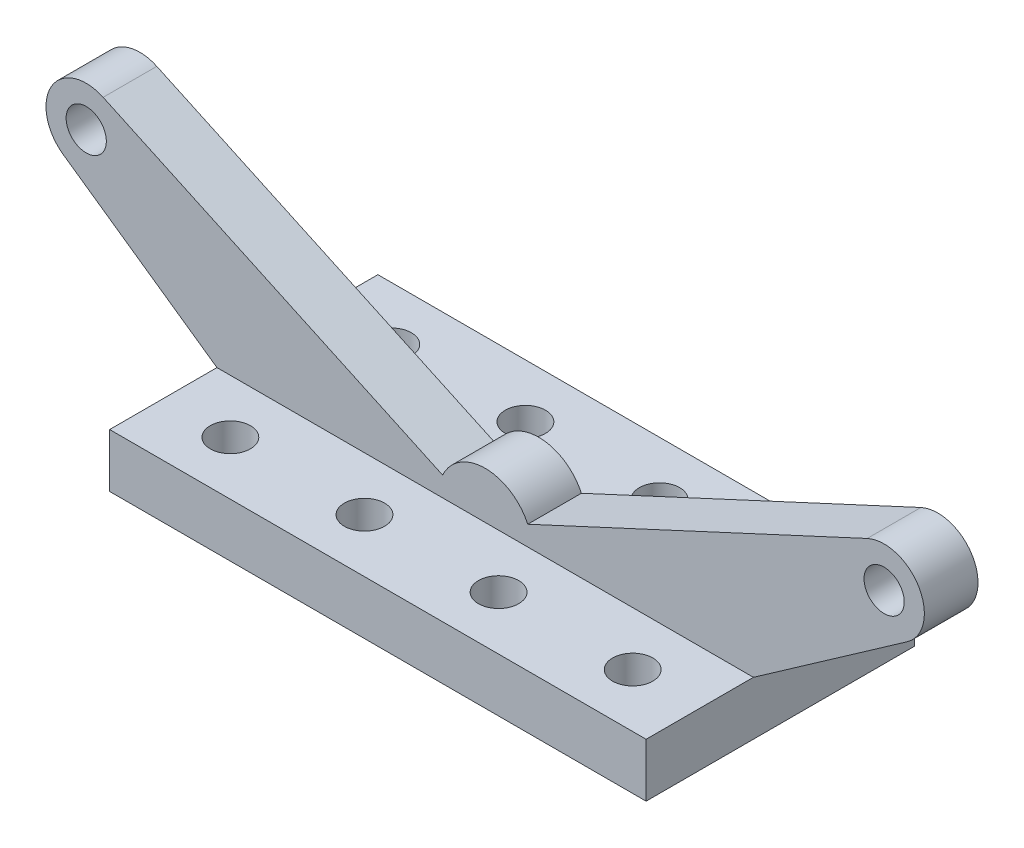
ISO-10303-21;
HEADER;
FILE_DESCRIPTION(('STEP AP214'),'2;1');
FILE_NAME('part.step','',(''),(''),'','','');
FILE_SCHEMA(('AUTOMOTIVE_DESIGN { 1 0 10303 214 1 1 1 1 }'));
ENDSEC;
DATA;
#1=APPLICATION_CONTEXT('core data for automotive mechanical design processes');
#2=APPLICATION_PROTOCOL_DEFINITION('international standard','automotive_design',2000,#1);
#3=PRODUCT_CONTEXT('',#1,'mechanical');
#4=PRODUCT('Part','Part','',(#3));
#5=PRODUCT_RELATED_PRODUCT_CATEGORY('part','',(#4));
#6=PRODUCT_DEFINITION_FORMATION('','',#4);
#7=PRODUCT_DEFINITION_CONTEXT('part definition',#1,'design');
#8=PRODUCT_DEFINITION('design','',#6,#7);
#9=PRODUCT_DEFINITION_SHAPE('','',#8);
#10=(LENGTH_UNIT() NAMED_UNIT(*) SI_UNIT(.MILLI.,.METRE.));
#11=(NAMED_UNIT(*) PLANE_ANGLE_UNIT() SI_UNIT($,.RADIAN.));
#12=(NAMED_UNIT(*) SI_UNIT($,.STERADIAN.) SOLID_ANGLE_UNIT());
#13=UNCERTAINTY_MEASURE_WITH_UNIT(LENGTH_MEASURE(1.E-05),#10,'distance_accuracy_value','');
#14=(GEOMETRIC_REPRESENTATION_CONTEXT(3) GLOBAL_UNCERTAINTY_ASSIGNED_CONTEXT((#13)) GLOBAL_UNIT_ASSIGNED_CONTEXT((#10,
#11,#12)) REPRESENTATION_CONTEXT('',''));
#15=CARTESIAN_POINT('',(0.,0.,0.));
#16=DIRECTION('',(0.,0.,1.));
#17=DIRECTION('',(1.,0.,0.));
#18=AXIS2_PLACEMENT_3D('',#15,#16,#17);
#19=CARTESIAN_POINT('',(0.,20.,0.));
#20=DIRECTION('',(0.,1.,0.));
#21=DIRECTION('',(0.,0.,1.));
#22=AXIS2_PLACEMENT_3D('',#19,#20,#21);
#23=PLANE('',#22);
#24=CARTESIAN_POINT('',(-75.,20.,-30.));
#25=DIRECTION('',(0.,1.,0.));
#26=DIRECTION('',(0.,0.,1.));
#27=AXIS2_PLACEMENT_3D('',#24,#25,#26);
#28=CIRCLE('',#27,7.50000000000001);
#29=CARTESIAN_POINT('',(-75.,20.,-22.5));
#30=VERTEX_POINT('',#29);
#31=EDGE_CURVE('E206',#30,#30,#28,.T.);
#32=ORIENTED_EDGE('',*,*,#31,.F.);
#33=EDGE_LOOP('',(#32));
#34=FACE_BOUND('',#33,.T.);
#35=CARTESIAN_POINT('',(75.,20.,-30.));
#36=DIRECTION('',(0.,1.,0.));
#37=DIRECTION('',(0.,0.,1.));
#38=AXIS2_PLACEMENT_3D('',#35,#36,#37);
#39=CIRCLE('',#38,7.50000000000001);
#40=CARTESIAN_POINT('',(75.,20.,-22.5));
#41=VERTEX_POINT('',#40);
#42=EDGE_CURVE('E219',#41,#41,#39,.T.);
#43=ORIENTED_EDGE('',*,*,#42,.F.);
#44=EDGE_LOOP('',(#43));
#45=FACE_BOUND('',#44,.T.);
#46=CARTESIAN_POINT('',(25.,20.,-30.));
#47=DIRECTION('',(0.,1.,0.));
#48=DIRECTION('',(0.,0.,1.));
#49=AXIS2_PLACEMENT_3D('',#46,#47,#48);
#50=CIRCLE('',#49,7.50000000000001);
#51=CARTESIAN_POINT('',(25.,20.,-22.5));
#52=VERTEX_POINT('',#51);
#53=EDGE_CURVE('E213',#52,#52,#50,.T.);
#54=ORIENTED_EDGE('',*,*,#53,.F.);
#55=EDGE_LOOP('',(#54));
#56=FACE_BOUND('',#55,.T.);
#57=CARTESIAN_POINT('',(-25.,20.,-30.));
#58=DIRECTION('',(0.,1.,0.));
#59=DIRECTION('',(0.,0.,1.));
#60=AXIS2_PLACEMENT_3D('',#57,#58,#59);
#61=CIRCLE('',#60,7.50000000000001);
#62=CARTESIAN_POINT('',(-25.,20.,-22.5));
#63=VERTEX_POINT('',#62);
#64=EDGE_CURVE('E207',#63,#63,#61,.T.);
#65=ORIENTED_EDGE('',*,*,#64,.F.);
#66=EDGE_LOOP('',(#65));
#67=FACE_BOUND('',#66,.T.);
#68=DIRECTION('',(0.,0.,1.));
#69=VECTOR('',#68,1.);
#70=CARTESIAN_POINT('',(-100.,20.,-50.));
#71=LINE('',#70,#69);
#72=CARTESIAN_POINT('',(-100.,20.,-50.));
#73=VERTEX_POINT('',#72);
#74=CARTESIAN_POINT('',(-100.,20.,-10.));
#75=VERTEX_POINT('',#74);
#76=EDGE_CURVE('E253',#73,#75,#71,.T.);
#77=ORIENTED_EDGE('',*,*,#76,.T.);
#78=DIRECTION('',(1.,0.,0.));
#79=VECTOR('',#78,1.);
#80=CARTESIAN_POINT('',(-100.,20.,-10.));
#81=LINE('',#80,#79);
#82=CARTESIAN_POINT('',(100.,20.,-10.));
#83=VERTEX_POINT('',#82);
#84=EDGE_CURVE('E171',#75,#83,#81,.T.);
#85=ORIENTED_EDGE('',*,*,#84,.T.);
#86=DIRECTION('',(0.,0.,-1.));
#87=VECTOR('',#86,1.);
#88=CARTESIAN_POINT('',(100.,20.,-50.));
#89=LINE('',#88,#87);
#90=CARTESIAN_POINT('',(100.,20.,-50.));
#91=VERTEX_POINT('',#90);
#92=EDGE_CURVE('E131',#83,#91,#89,.T.);
#93=ORIENTED_EDGE('',*,*,#92,.T.);
#94=DIRECTION('',(-1.,0.,0.));
#95=VECTOR('',#94,1.);
#96=CARTESIAN_POINT('',(-100.,20.,-50.));
#97=LINE('',#96,#95);
#98=EDGE_CURVE('E130',#91,#73,#97,.T.);
#99=ORIENTED_EDGE('',*,*,#98,.T.);
#100=EDGE_LOOP('',(#77,#85,#93,#99));
#101=FACE_BOUND('',#100,.T.);
#102=ADVANCED_FACE('F33',(#34,#45,#56,#67,#101),#23,.T.);
#103=CARTESIAN_POINT('',(100.,20.,-50.));
#104=DIRECTION('',(-1.,0.,0.));
#105=DIRECTION('',(0.,0.,1.));
#106=AXIS2_PLACEMENT_3D('',#103,#104,#105);
#107=PLANE('',#106);
#108=DIRECTION('',(0.,0.,-1.));
#109=VECTOR('',#108,1.);
#110=CARTESIAN_POINT('',(100.,0.,-50.));
#111=LINE('',#110,#109);
#112=CARTESIAN_POINT('',(100.,0.,50.));
#113=VERTEX_POINT('',#112);
#114=CARTESIAN_POINT('',(100.,0.,-50.));
#115=VERTEX_POINT('',#114);
#116=EDGE_CURVE('E248',#113,#115,#111,.T.);
#117=ORIENTED_EDGE('',*,*,#116,.T.);
#118=DIRECTION('',(0.,-1.,0.));
#119=VECTOR('',#118,1.);
#120=CARTESIAN_POINT('',(100.,20.,-50.));
#121=LINE('',#120,#119);
#122=EDGE_CURVE('E11',#91,#115,#121,.T.);
#123=ORIENTED_EDGE('',*,*,#122,.F.);
#124=ORIENTED_EDGE('',*,*,#92,.F.);
#125=DIRECTION('',(0.,0.,-1.));
#126=VECTOR('',#125,1.);
#127=CARTESIAN_POINT('',(100.,20.,10.));
#128=LINE('',#127,#126);
#129=CARTESIAN_POINT('',(100.,20.,10.));
#130=VERTEX_POINT('',#129);
#131=EDGE_CURVE('E135',#130,#83,#128,.T.);
#132=ORIENTED_EDGE('',*,*,#131,.F.);
#133=CARTESIAN_POINT('',(100.,20.,50.));
#134=VERTEX_POINT('',#133);
#135=EDGE_CURVE('E121',#134,#130,#89,.T.);
#136=ORIENTED_EDGE('',*,*,#135,.F.);
#137=DIRECTION('',(0.,-1.,0.));
#138=VECTOR('',#137,1.);
#139=CARTESIAN_POINT('',(100.,20.,50.));
#140=LINE('',#139,#138);
#141=EDGE_CURVE('E256',#134,#113,#140,.T.);
#142=ORIENTED_EDGE('',*,*,#141,.T.);
#143=EDGE_LOOP('',(#117,#123,#124,#132,#136,#142));
#144=FACE_BOUND('',#143,.T.);
#145=ADVANCED_FACE('F35',(#144),#107,.F.);
#146=CARTESIAN_POINT('',(-100.,20.,-50.));
#147=DIRECTION('',(0.,0.,1.));
#148=DIRECTION('',(1.,0.,0.));
#149=AXIS2_PLACEMENT_3D('',#146,#147,#148);
#150=PLANE('',#149);
#151=DIRECTION('',(-1.,0.,0.));
#152=VECTOR('',#151,1.);
#153=CARTESIAN_POINT('',(-100.,0.,-50.));
#154=LINE('',#153,#152);
#155=CARTESIAN_POINT('',(-100.,0.,-50.));
#156=VERTEX_POINT('',#155);
#157=EDGE_CURVE('E258',#115,#156,#154,.T.);
#158=ORIENTED_EDGE('',*,*,#157,.T.);
#159=DIRECTION('',(0.,-1.,0.));
#160=VECTOR('',#159,1.);
#161=CARTESIAN_POINT('',(-100.,20.,-50.));
#162=LINE('',#161,#160);
#163=EDGE_CURVE('E41',#73,#156,#162,.T.);
#164=ORIENTED_EDGE('',*,*,#163,.F.);
#165=ORIENTED_EDGE('',*,*,#98,.F.);
#166=ORIENTED_EDGE('',*,*,#122,.T.);
#167=EDGE_LOOP('',(#158,#164,#165,#166));
#168=FACE_BOUND('',#167,.T.);
#169=ADVANCED_FACE('F280',(#168),#150,.F.);
#170=CARTESIAN_POINT('',(-100.,20.,-50.));
#171=DIRECTION('',(1.,0.,0.));
#172=DIRECTION('',(0.,0.,-1.));
#173=AXIS2_PLACEMENT_3D('',#170,#171,#172);
#174=PLANE('',#173);
#175=DIRECTION('',(0.,0.,1.));
#176=VECTOR('',#175,1.);
#177=CARTESIAN_POINT('',(-100.,0.,-50.));
#178=LINE('',#177,#176);
#179=CARTESIAN_POINT('',(-100.,0.,50.));
#180=VERTEX_POINT('',#179);
#181=EDGE_CURVE('E260',#156,#180,#178,.T.);
#182=ORIENTED_EDGE('',*,*,#181,.T.);
#183=DIRECTION('',(0.,-1.,0.));
#184=VECTOR('',#183,1.);
#185=CARTESIAN_POINT('',(-100.,20.,50.));
#186=LINE('',#185,#184);
#187=CARTESIAN_POINT('',(-100.,20.,50.));
#188=VERTEX_POINT('',#187);
#189=EDGE_CURVE('E265',#188,#180,#186,.T.);
#190=ORIENTED_EDGE('',*,*,#189,.F.);
#191=CARTESIAN_POINT('',(-100.,20.,10.));
#192=VERTEX_POINT('',#191);
#193=EDGE_CURVE('E252',#192,#188,#71,.T.);
#194=ORIENTED_EDGE('',*,*,#193,.F.);
#195=DIRECTION('',(0.,0.,-1.));
#196=VECTOR('',#195,1.);
#197=CARTESIAN_POINT('',(-100.,20.,10.));
#198=LINE('',#197,#196);
#199=EDGE_CURVE('E55',#192,#75,#198,.T.);
#200=ORIENTED_EDGE('',*,*,#199,.T.);
#201=ORIENTED_EDGE('',*,*,#76,.F.);
#202=ORIENTED_EDGE('',*,*,#163,.T.);
#203=EDGE_LOOP('',(#182,#190,#194,#200,#201,#202));
#204=FACE_BOUND('',#203,.T.);
#205=ADVANCED_FACE('F270',(#204),#174,.F.);
#206=CARTESIAN_POINT('',(-100.,20.,50.));
#207=DIRECTION('',(0.,0.,-1.));
#208=DIRECTION('',(-1.,0.,0.));
#209=AXIS2_PLACEMENT_3D('',#206,#207,#208);
#210=PLANE('',#209);
#211=DIRECTION('',(1.,0.,0.));
#212=VECTOR('',#211,1.);
#213=CARTESIAN_POINT('',(-100.,0.,50.));
#214=LINE('',#213,#212);
#215=EDGE_CURVE('E262',#180,#113,#214,.T.);
#216=ORIENTED_EDGE('',*,*,#215,.T.);
#217=ORIENTED_EDGE('',*,*,#141,.F.);
#218=DIRECTION('',(1.,0.,0.));
#219=VECTOR('',#218,1.);
#220=CARTESIAN_POINT('',(-100.,20.,50.));
#221=LINE('',#220,#219);
#222=EDGE_CURVE('E126',#188,#134,#221,.T.);
#223=ORIENTED_EDGE('',*,*,#222,.F.);
#224=ORIENTED_EDGE('',*,*,#189,.T.);
#225=EDGE_LOOP('',(#216,#217,#223,#224));
#226=FACE_BOUND('',#225,.T.);
#227=ADVANCED_FACE('F279',(#226),#210,.F.);
#228=DIRECTION('',(1.,0.,0.));
#229=VECTOR('',#228,1.);
#230=CARTESIAN_POINT('',(-100.,20.,10.));
#231=LINE('',#230,#229);
#232=EDGE_CURVE('E48',#192,#130,#231,.T.);
#233=ORIENTED_EDGE('',*,*,#232,.F.);
#234=ORIENTED_EDGE('',*,*,#193,.T.);
#235=ORIENTED_EDGE('',*,*,#222,.T.);
#236=ORIENTED_EDGE('',*,*,#135,.T.);
#237=EDGE_LOOP('',(#233,#234,#235,#236));
#238=FACE_BOUND('',#237,.T.);
#239=CARTESIAN_POINT('',(-75.,20.,30.));
#240=DIRECTION('',(0.,1.,0.));
#241=DIRECTION('',(0.,0.,1.));
#242=AXIS2_PLACEMENT_3D('',#239,#240,#241);
#243=CIRCLE('',#242,7.50000000000001);
#244=CARTESIAN_POINT('',(-75.,20.,37.5));
#245=VERTEX_POINT('',#244);
#246=EDGE_CURVE('E225',#245,#245,#243,.T.);
#247=ORIENTED_EDGE('',*,*,#246,.F.);
#248=EDGE_LOOP('',(#247));
#249=FACE_BOUND('',#248,.T.);
#250=CARTESIAN_POINT('',(-25.,20.,30.));
#251=DIRECTION('',(0.,1.,0.));
#252=DIRECTION('',(0.,0.,1.));
#253=AXIS2_PLACEMENT_3D('',#250,#251,#252);
#254=CIRCLE('',#253,7.50000000000001);
#255=CARTESIAN_POINT('',(-25.,20.,37.5));
#256=VERTEX_POINT('',#255);
#257=EDGE_CURVE('E231',#256,#256,#254,.T.);
#258=ORIENTED_EDGE('',*,*,#257,.F.);
#259=EDGE_LOOP('',(#258));
#260=FACE_BOUND('',#259,.T.);
#261=CARTESIAN_POINT('',(25.,20.,30.));
#262=DIRECTION('',(0.,1.,0.));
#263=DIRECTION('',(0.,0.,1.));
#264=AXIS2_PLACEMENT_3D('',#261,#262,#263);
#265=CIRCLE('',#264,7.50000000000001);
#266=CARTESIAN_POINT('',(25.,20.,37.5));
#267=VERTEX_POINT('',#266);
#268=EDGE_CURVE('E237',#267,#267,#265,.T.);
#269=ORIENTED_EDGE('',*,*,#268,.F.);
#270=EDGE_LOOP('',(#269));
#271=FACE_BOUND('',#270,.T.);
#272=CARTESIAN_POINT('',(75.,20.,30.));
#273=DIRECTION('',(0.,1.,0.));
#274=DIRECTION('',(0.,0.,1.));
#275=AXIS2_PLACEMENT_3D('',#272,#273,#274);
#276=CIRCLE('',#275,7.50000000000001);
#277=CARTESIAN_POINT('',(75.,20.,37.5));
#278=VERTEX_POINT('',#277);
#279=EDGE_CURVE('E202',#278,#278,#276,.T.);
#280=ORIENTED_EDGE('',*,*,#279,.F.);
#281=EDGE_LOOP('',(#280));
#282=FACE_BOUND('',#281,.T.);
#283=ADVANCED_FACE('F123',(#238,#249,#260,#271,#282),#23,.T.);
#284=CARTESIAN_POINT('',(0.,0.,0.));
#285=DIRECTION('',(0.,1.,0.));
#286=DIRECTION('',(0.,0.,1.));
#287=AXIS2_PLACEMENT_3D('',#284,#285,#286);
#288=PLANE('',#287);
#289=CARTESIAN_POINT('',(-25.,0.,-30.));
#290=DIRECTION('',(0.,1.,0.));
#291=DIRECTION('',(0.,0.,1.));
#292=AXIS2_PLACEMENT_3D('',#289,#290,#291);
#293=CIRCLE('',#292,7.50000000000001);
#294=CARTESIAN_POINT('',(-25.,0.,-22.5));
#295=VERTEX_POINT('',#294);
#296=EDGE_CURVE('E203',#295,#295,#293,.T.);
#297=ORIENTED_EDGE('',*,*,#296,.T.);
#298=EDGE_LOOP('',(#297));
#299=FACE_BOUND('',#298,.T.);
#300=CARTESIAN_POINT('',(25.,0.,-30.));
#301=DIRECTION('',(0.,1.,0.));
#302=DIRECTION('',(0.,0.,1.));
#303=AXIS2_PLACEMENT_3D('',#300,#301,#302);
#304=CIRCLE('',#303,7.50000000000001);
#305=CARTESIAN_POINT('',(25.,0.,-22.5));
#306=VERTEX_POINT('',#305);
#307=EDGE_CURVE('E210',#306,#306,#304,.T.);
#308=ORIENTED_EDGE('',*,*,#307,.T.);
#309=EDGE_LOOP('',(#308));
#310=FACE_BOUND('',#309,.T.);
#311=CARTESIAN_POINT('',(75.,0.,-30.));
#312=DIRECTION('',(0.,1.,0.));
#313=DIRECTION('',(0.,0.,1.));
#314=AXIS2_PLACEMENT_3D('',#311,#312,#313);
#315=CIRCLE('',#314,7.50000000000001);
#316=CARTESIAN_POINT('',(75.,0.,-22.5));
#317=VERTEX_POINT('',#316);
#318=EDGE_CURVE('E216',#317,#317,#315,.T.);
#319=ORIENTED_EDGE('',*,*,#318,.T.);
#320=EDGE_LOOP('',(#319));
#321=FACE_BOUND('',#320,.T.);
#322=CARTESIAN_POINT('',(-75.,0.,30.));
#323=DIRECTION('',(0.,1.,0.));
#324=DIRECTION('',(0.,0.,1.));
#325=AXIS2_PLACEMENT_3D('',#322,#323,#324);
#326=CIRCLE('',#325,7.50000000000001);
#327=CARTESIAN_POINT('',(-75.,0.,37.5));
#328=VERTEX_POINT('',#327);
#329=EDGE_CURVE('E222',#328,#328,#326,.T.);
#330=ORIENTED_EDGE('',*,*,#329,.T.);
#331=EDGE_LOOP('',(#330));
#332=FACE_BOUND('',#331,.T.);
#333=CARTESIAN_POINT('',(-25.,0.,30.));
#334=DIRECTION('',(0.,1.,0.));
#335=DIRECTION('',(0.,0.,1.));
#336=AXIS2_PLACEMENT_3D('',#333,#334,#335);
#337=CIRCLE('',#336,7.50000000000001);
#338=CARTESIAN_POINT('',(-25.,0.,37.5));
#339=VERTEX_POINT('',#338);
#340=EDGE_CURVE('E228',#339,#339,#337,.T.);
#341=ORIENTED_EDGE('',*,*,#340,.T.);
#342=EDGE_LOOP('',(#341));
#343=FACE_BOUND('',#342,.T.);
#344=CARTESIAN_POINT('',(25.,0.,30.));
#345=DIRECTION('',(0.,1.,0.));
#346=DIRECTION('',(0.,0.,1.));
#347=AXIS2_PLACEMENT_3D('',#344,#345,#346);
#348=CIRCLE('',#347,7.50000000000001);
#349=CARTESIAN_POINT('',(25.,0.,37.5));
#350=VERTEX_POINT('',#349);
#351=EDGE_CURVE('E234',#350,#350,#348,.T.);
#352=ORIENTED_EDGE('',*,*,#351,.T.);
#353=EDGE_LOOP('',(#352));
#354=FACE_BOUND('',#353,.T.);
#355=CARTESIAN_POINT('',(75.,0.,30.));
#356=DIRECTION('',(0.,1.,0.));
#357=DIRECTION('',(0.,0.,1.));
#358=AXIS2_PLACEMENT_3D('',#355,#356,#357);
#359=CIRCLE('',#358,7.50000000000001);
#360=CARTESIAN_POINT('',(75.,0.,37.5));
#361=VERTEX_POINT('',#360);
#362=EDGE_CURVE('E240',#361,#361,#359,.T.);
#363=ORIENTED_EDGE('',*,*,#362,.T.);
#364=EDGE_LOOP('',(#363));
#365=FACE_BOUND('',#364,.T.);
#366=CARTESIAN_POINT('',(-75.,0.,-30.));
#367=DIRECTION('',(0.,1.,0.));
#368=DIRECTION('',(0.,0.,1.));
#369=AXIS2_PLACEMENT_3D('',#366,#367,#368);
#370=CIRCLE('',#369,7.50000000000001);
#371=CARTESIAN_POINT('',(-75.,0.,-22.5));
#372=VERTEX_POINT('',#371);
#373=EDGE_CURVE('E245',#372,#372,#370,.T.);
#374=ORIENTED_EDGE('',*,*,#373,.T.);
#375=EDGE_LOOP('',(#374));
#376=FACE_BOUND('',#375,.T.);
#377=ORIENTED_EDGE('',*,*,#116,.F.);
#378=ORIENTED_EDGE('',*,*,#215,.F.);
#379=ORIENTED_EDGE('',*,*,#181,.F.);
#380=ORIENTED_EDGE('',*,*,#157,.F.);
#381=EDGE_LOOP('',(#377,#378,#379,#380));
#382=FACE_BOUND('',#381,.T.);
#383=ADVANCED_FACE('F277',(#299,#310,#321,#332,#343,#354,#365,#376,#382),#288,.F.);
#384=CARTESIAN_POINT('',(-75.,0.,-30.));
#385=DIRECTION('',(0.,1.,0.));
#386=DIRECTION('',(0.,0.,1.));
#387=AXIS2_PLACEMENT_3D('',#384,#385,#386);
#388=CYLINDRICAL_SURFACE('',#387,7.50000000000001);
#389=ORIENTED_EDGE('',*,*,#373,.F.);
#390=EDGE_LOOP('',(#389));
#391=FACE_BOUND('',#390,.T.);
#392=ORIENTED_EDGE('',*,*,#31,.T.);
#393=EDGE_LOOP('',(#392));
#394=FACE_BOUND('',#393,.T.);
#395=ADVANCED_FACE('F335',(#391,#394),#388,.F.);
#396=CARTESIAN_POINT('',(75.,0.,30.));
#397=DIRECTION('',(0.,1.,0.));
#398=DIRECTION('',(0.,0.,1.));
#399=AXIS2_PLACEMENT_3D('',#396,#397,#398);
#400=CYLINDRICAL_SURFACE('',#399,7.50000000000001);
#401=ORIENTED_EDGE('',*,*,#362,.F.);
#402=EDGE_LOOP('',(#401));
#403=FACE_BOUND('',#402,.T.);
#404=ORIENTED_EDGE('',*,*,#279,.T.);
#405=EDGE_LOOP('',(#404));
#406=FACE_BOUND('',#405,.T.);
#407=ADVANCED_FACE('F514',(#403,#406),#400,.F.);
#408=CARTESIAN_POINT('',(25.,0.,30.));
#409=DIRECTION('',(0.,1.,0.));
#410=DIRECTION('',(0.,0.,1.));
#411=AXIS2_PLACEMENT_3D('',#408,#409,#410);
#412=CYLINDRICAL_SURFACE('',#411,7.50000000000001);
#413=ORIENTED_EDGE('',*,*,#351,.F.);
#414=EDGE_LOOP('',(#413));
#415=FACE_BOUND('',#414,.T.);
#416=ORIENTED_EDGE('',*,*,#268,.T.);
#417=EDGE_LOOP('',(#416));
#418=FACE_BOUND('',#417,.T.);
#419=ADVANCED_FACE('F506',(#415,#418),#412,.F.);
#420=CARTESIAN_POINT('',(-25.,0.,30.));
#421=DIRECTION('',(0.,1.,0.));
#422=DIRECTION('',(0.,0.,1.));
#423=AXIS2_PLACEMENT_3D('',#420,#421,#422);
#424=CYLINDRICAL_SURFACE('',#423,7.50000000000001);
#425=ORIENTED_EDGE('',*,*,#340,.F.);
#426=EDGE_LOOP('',(#425));
#427=FACE_BOUND('',#426,.T.);
#428=ORIENTED_EDGE('',*,*,#257,.T.);
#429=EDGE_LOOP('',(#428));
#430=FACE_BOUND('',#429,.T.);
#431=ADVANCED_FACE('F498',(#427,#430),#424,.F.);
#432=CARTESIAN_POINT('',(-75.,0.,30.));
#433=DIRECTION('',(0.,1.,0.));
#434=DIRECTION('',(0.,0.,1.));
#435=AXIS2_PLACEMENT_3D('',#432,#433,#434);
#436=CYLINDRICAL_SURFACE('',#435,7.50000000000001);
#437=ORIENTED_EDGE('',*,*,#329,.F.);
#438=EDGE_LOOP('',(#437));
#439=FACE_BOUND('',#438,.T.);
#440=ORIENTED_EDGE('',*,*,#246,.T.);
#441=EDGE_LOOP('',(#440));
#442=FACE_BOUND('',#441,.T.);
#443=ADVANCED_FACE('F490',(#439,#442),#436,.F.);
#444=CARTESIAN_POINT('',(75.,0.,-30.));
#445=DIRECTION('',(0.,1.,0.));
#446=DIRECTION('',(0.,0.,1.));
#447=AXIS2_PLACEMENT_3D('',#444,#445,#446);
#448=CYLINDRICAL_SURFACE('',#447,7.50000000000001);
#449=ORIENTED_EDGE('',*,*,#318,.F.);
#450=EDGE_LOOP('',(#449));
#451=FACE_BOUND('',#450,.T.);
#452=ORIENTED_EDGE('',*,*,#42,.T.);
#453=EDGE_LOOP('',(#452));
#454=FACE_BOUND('',#453,.T.);
#455=ADVANCED_FACE('F482',(#451,#454),#448,.F.);
#456=CARTESIAN_POINT('',(25.,0.,-30.));
#457=DIRECTION('',(0.,1.,0.));
#458=DIRECTION('',(0.,0.,1.));
#459=AXIS2_PLACEMENT_3D('',#456,#457,#458);
#460=CYLINDRICAL_SURFACE('',#459,7.50000000000001);
#461=ORIENTED_EDGE('',*,*,#307,.F.);
#462=EDGE_LOOP('',(#461));
#463=FACE_BOUND('',#462,.T.);
#464=ORIENTED_EDGE('',*,*,#53,.T.);
#465=EDGE_LOOP('',(#464));
#466=FACE_BOUND('',#465,.T.);
#467=ADVANCED_FACE('F474',(#463,#466),#460,.F.);
#468=CARTESIAN_POINT('',(-25.,0.,-30.));
#469=DIRECTION('',(0.,1.,0.));
#470=DIRECTION('',(0.,0.,1.));
#471=AXIS2_PLACEMENT_3D('',#468,#469,#470);
#472=CYLINDRICAL_SURFACE('',#471,7.50000000000001);
#473=ORIENTED_EDGE('',*,*,#296,.F.);
#474=EDGE_LOOP('',(#473));
#475=FACE_BOUND('',#474,.T.);
#476=ORIENTED_EDGE('',*,*,#64,.T.);
#477=EDGE_LOOP('',(#476));
#478=FACE_BOUND('',#477,.T.);
#479=ADVANCED_FACE('F368',(#475,#478),#472,.F.);
#480=CARTESIAN_POINT('',(-100.,20.,10.));
#481=DIRECTION('',(0.573576436351041,0.819152044288995,0.));
#482=DIRECTION('',(-0.819152044288995,0.573576436351041,0.));
#483=AXIS2_PLACEMENT_3D('',#480,#481,#482);
#484=PLANE('',#483);
#485=DIRECTION('',(0.819152044288995,-0.573576436351041,0.));
#486=VECTOR('',#485,1.);
#487=CARTESIAN_POINT('',(-100.,20.,-10.));
#488=LINE('',#487,#486);
#489=CARTESIAN_POINT('',(-157.34064310023,60.1503505445729,-10.));
#490=VERTEX_POINT('',#489);
#491=EDGE_CURVE('E168',#490,#75,#488,.T.);
#492=ORIENTED_EDGE('',*,*,#491,.T.);
#493=ORIENTED_EDGE('',*,*,#199,.F.);
#494=DIRECTION('',(0.819152044288995,-0.573576436351041,0.));
#495=VECTOR('',#494,1.);
#496=CARTESIAN_POINT('',(-100.,20.,10.));
#497=LINE('',#496,#495);
#498=CARTESIAN_POINT('',(-157.34064310023,60.1503505445729,10.));
#499=VERTEX_POINT('',#498);
#500=EDGE_CURVE('E149',#499,#192,#497,.T.);
#501=ORIENTED_EDGE('',*,*,#500,.F.);
#502=DIRECTION('',(0.,0.,-1.));
#503=VECTOR('',#502,1.);
#504=CARTESIAN_POINT('',(-157.34064310023,60.1503505445729,10.));
#505=LINE('',#504,#503);
#506=EDGE_CURVE('E167',#499,#490,#505,.T.);
#507=ORIENTED_EDGE('',*,*,#506,.T.);
#508=EDGE_LOOP('',(#492,#493,#501,#507));
#509=FACE_BOUND('',#508,.T.);
#510=ADVANCED_FACE('F289',(#509),#484,.F.);
#511=CARTESIAN_POINT('',(100.,20.,10.));
#512=DIRECTION('',(-0.573576436351047,0.819152044288991,0.));
#513=DIRECTION('',(-0.819152044288991,-0.573576436351047,0.));
#514=AXIS2_PLACEMENT_3D('',#511,#512,#513);
#515=PLANE('',#514);
#516=DIRECTION('',(0.819152044288991,0.573576436351047,0.));
#517=VECTOR('',#516,1.);
#518=CARTESIAN_POINT('',(100.,20.,-10.));
#519=LINE('',#518,#517);
#520=CARTESIAN_POINT('',(157.340643100229,60.1503505445733,-10.));
#521=VERTEX_POINT('',#520);
#522=EDGE_CURVE('E174',#83,#521,#519,.T.);
#523=ORIENTED_EDGE('',*,*,#522,.T.);
#524=DIRECTION('',(0.,0.,-1.));
#525=VECTOR('',#524,1.);
#526=CARTESIAN_POINT('',(157.340643100229,60.1503505445733,10.));
#527=LINE('',#526,#525);
#528=CARTESIAN_POINT('',(157.340643100229,60.1503505445733,10.));
#529=VERTEX_POINT('',#528);
#530=EDGE_CURVE('E141',#529,#521,#527,.T.);
#531=ORIENTED_EDGE('',*,*,#530,.F.);
#532=DIRECTION('',(0.819152044288991,0.573576436351047,0.));
#533=VECTOR('',#532,1.);
#534=CARTESIAN_POINT('',(100.,20.,10.));
#535=LINE('',#534,#533);
#536=EDGE_CURVE('E146',#130,#529,#535,.T.);
#537=ORIENTED_EDGE('',*,*,#536,.F.);
#538=ORIENTED_EDGE('',*,*,#131,.T.);
#539=EDGE_LOOP('',(#523,#531,#537,#538));
#540=FACE_BOUND('',#539,.T.);
#541=ADVANCED_FACE('F151',(#540),#515,.F.);
#542=CARTESIAN_POINT('',(148.736996554964,72.4376312089082,10.));
#543=DIRECTION('',(0.,0.,-1.));
#544=DIRECTION('',(-1.,0.,0.));
#545=AXIS2_PLACEMENT_3D('',#542,#543,#544);
#546=CYLINDRICAL_SURFACE('',#545,15.);
#547=CARTESIAN_POINT('',(148.736996554964,72.4376312089082,-10.));
#548=DIRECTION('',(0.,0.,1.));
#549=DIRECTION('',(1.,0.,0.));
#550=AXIS2_PLACEMENT_3D('',#547,#548,#549);
#551=CIRCLE('',#550,15.);
#552=CARTESIAN_POINT('',(142.426691143872,86.0457187166644,-10.));
#553=VERTEX_POINT('',#552);
#554=EDGE_CURVE('E176',#521,#553,#551,.T.);
#555=ORIENTED_EDGE('',*,*,#554,.T.);
#556=DIRECTION('',(0.,0.,-1.));
#557=VECTOR('',#556,1.);
#558=CARTESIAN_POINT('',(142.426691143872,86.0457187166644,10.));
#559=LINE('',#558,#557);
#560=CARTESIAN_POINT('',(142.426691143872,86.0457187166644,10.));
#561=VERTEX_POINT('',#560);
#562=EDGE_CURVE('E197',#561,#553,#559,.T.);
#563=ORIENTED_EDGE('',*,*,#562,.F.);
#564=CARTESIAN_POINT('',(148.736996554964,72.4376312089082,10.));
#565=DIRECTION('',(0.,0.,1.));
#566=DIRECTION('',(1.,0.,0.));
#567=AXIS2_PLACEMENT_3D('',#564,#565,#566);
#568=CIRCLE('',#567,15.);
#569=EDGE_CURVE('E154',#529,#561,#568,.T.);
#570=ORIENTED_EDGE('',*,*,#569,.F.);
#571=ORIENTED_EDGE('',*,*,#530,.T.);
#572=EDGE_LOOP('',(#555,#563,#570,#571));
#573=FACE_BOUND('',#572,.T.);
#574=ADVANCED_FACE('F311',(#573),#546,.T.);
#575=CARTESIAN_POINT('',(142.426691143872,86.0457187166644,10.));
#576=DIRECTION('',(0.420687027406094,-0.907205833850414,0.));
#577=DIRECTION('',(0.907205833850414,0.420687027406094,0.));
#578=AXIS2_PLACEMENT_3D('',#575,#576,#577);
#579=PLANE('',#578);
#580=DIRECTION('',(-0.907205833850414,-0.420687027406094,0.));
#581=VECTOR('',#580,1.);
#582=CARTESIAN_POINT('',(142.426691143872,86.0457187166644,-10.));
#583=LINE('',#582,#581);
#584=CARTESIAN_POINT('',(15.8761020923823,27.3620229796066,-10.));
#585=VERTEX_POINT('',#584);
#586=EDGE_CURVE('E178',#553,#585,#583,.T.);
#587=ORIENTED_EDGE('',*,*,#586,.T.);
#588=DIRECTION('',(0.,0.,-1.));
#589=VECTOR('',#588,1.);
#590=CARTESIAN_POINT('',(15.8761020923823,27.3620229796066,10.));
#591=LINE('',#590,#589);
#592=CARTESIAN_POINT('',(15.8761020923823,27.3620229796066,10.));
#593=VERTEX_POINT('',#592);
#594=EDGE_CURVE('E194',#593,#585,#591,.T.);
#595=ORIENTED_EDGE('',*,*,#594,.F.);
#596=DIRECTION('',(-0.907205833850414,-0.420687027406094,0.));
#597=VECTOR('',#596,1.);
#598=CARTESIAN_POINT('',(142.426691143872,86.0457187166644,10.));
#599=LINE('',#598,#597);
#600=EDGE_CURVE('E156',#561,#593,#599,.T.);
#601=ORIENTED_EDGE('',*,*,#600,.F.);
#602=ORIENTED_EDGE('',*,*,#562,.T.);
#603=EDGE_LOOP('',(#587,#595,#601,#602));
#604=FACE_BOUND('',#603,.T.);
#605=ADVANCED_FACE('F308',(#604),#579,.F.);
#606=CARTESIAN_POINT('',(0.,20.,10.));
#607=DIRECTION('',(0.,0.,-1.));
#608=DIRECTION('',(-1.,0.,0.));
#609=AXIS2_PLACEMENT_3D('',#606,#607,#608);
#610=CYLINDRICAL_SURFACE('',#609,17.5);
#611=CARTESIAN_POINT('',(0.,20.,-10.));
#612=DIRECTION('',(0.,0.,1.));
#613=DIRECTION('',(1.,0.,0.));
#614=AXIS2_PLACEMENT_3D('',#611,#612,#613);
#615=CIRCLE('',#614,17.5);
#616=CARTESIAN_POINT('',(-15.8761020923823,27.3620229796066,-10.));
#617=VERTEX_POINT('',#616);
#618=EDGE_CURVE('E180',#585,#617,#615,.T.);
#619=ORIENTED_EDGE('',*,*,#618,.T.);
#620=DIRECTION('',(0.,0.,-1.));
#621=VECTOR('',#620,1.);
#622=CARTESIAN_POINT('',(-15.8761020923823,27.3620229796066,10.));
#623=LINE('',#622,#621);
#624=CARTESIAN_POINT('',(-15.8761020923823,27.3620229796066,10.));
#625=VERTEX_POINT('',#624);
#626=EDGE_CURVE('E191',#625,#617,#623,.T.);
#627=ORIENTED_EDGE('',*,*,#626,.F.);
#628=CARTESIAN_POINT('',(0.,20.,10.));
#629=DIRECTION('',(0.,0.,1.));
#630=DIRECTION('',(1.,0.,0.));
#631=AXIS2_PLACEMENT_3D('',#628,#629,#630);
#632=CIRCLE('',#631,17.5);
#633=EDGE_CURVE('E161',#593,#625,#632,.T.);
#634=ORIENTED_EDGE('',*,*,#633,.F.);
#635=ORIENTED_EDGE('',*,*,#594,.T.);
#636=EDGE_LOOP('',(#619,#627,#634,#635));
#637=FACE_BOUND('',#636,.T.);
#638=ADVANCED_FACE('F304',(#637),#610,.T.);
#639=CARTESIAN_POINT('',(-142.426691143873,86.0457187166641,10.));
#640=DIRECTION('',(-0.420687027406091,-0.907205833850415,0.));
#641=DIRECTION('',(0.907205833850415,-0.420687027406091,0.));
#642=AXIS2_PLACEMENT_3D('',#639,#640,#641);
#643=PLANE('',#642);
#644=DIRECTION('',(-0.907205833850415,0.420687027406091,0.));
#645=VECTOR('',#644,1.);
#646=CARTESIAN_POINT('',(-142.426691143873,86.0457187166641,-10.));
#647=LINE('',#646,#645);
#648=CARTESIAN_POINT('',(-142.426691143873,86.0457187166641,-10.));
#649=VERTEX_POINT('',#648);
#650=EDGE_CURVE('E182',#617,#649,#647,.T.);
#651=ORIENTED_EDGE('',*,*,#650,.T.);
#652=DIRECTION('',(0.,0.,-1.));
#653=VECTOR('',#652,1.);
#654=CARTESIAN_POINT('',(-142.426691143873,86.0457187166641,10.));
#655=LINE('',#654,#653);
#656=CARTESIAN_POINT('',(-142.426691143873,86.0457187166641,10.));
#657=VERTEX_POINT('',#656);
#658=EDGE_CURVE('E188',#657,#649,#655,.T.);
#659=ORIENTED_EDGE('',*,*,#658,.F.);
#660=DIRECTION('',(-0.907205833850415,0.420687027406091,0.));
#661=VECTOR('',#660,1.);
#662=CARTESIAN_POINT('',(-142.426691143873,86.0457187166641,10.));
#663=LINE('',#662,#661);
#664=EDGE_CURVE('E163',#625,#657,#663,.T.);
#665=ORIENTED_EDGE('',*,*,#664,.F.);
#666=ORIENTED_EDGE('',*,*,#626,.T.);
#667=EDGE_LOOP('',(#651,#659,#665,#666));
#668=FACE_BOUND('',#667,.T.);
#669=ADVANCED_FACE('F299',(#668),#643,.F.);
#670=CARTESIAN_POINT('',(-148.736996554964,72.4376312089078,10.));
#671=DIRECTION('',(0.,0.,-1.));
#672=DIRECTION('',(-1.,0.,0.));
#673=AXIS2_PLACEMENT_3D('',#670,#671,#672);
#674=CYLINDRICAL_SURFACE('',#673,15.);
#675=CARTESIAN_POINT('',(-148.736996554964,72.4376312089078,-10.));
#676=DIRECTION('',(0.,0.,1.));
#677=DIRECTION('',(-1.,0.,0.));
#678=AXIS2_PLACEMENT_3D('',#675,#676,#677);
#679=CIRCLE('',#678,15.);
#680=EDGE_CURVE('E184',#649,#490,#679,.T.);
#681=ORIENTED_EDGE('',*,*,#680,.T.);
#682=ORIENTED_EDGE('',*,*,#506,.F.);
#683=CARTESIAN_POINT('',(-148.736996554964,72.4376312089078,10.));
#684=DIRECTION('',(0.,0.,1.));
#685=DIRECTION('',(-1.,0.,0.));
#686=AXIS2_PLACEMENT_3D('',#683,#684,#685);
#687=CIRCLE('',#686,15.);
#688=EDGE_CURVE('E165',#657,#499,#687,.T.);
#689=ORIENTED_EDGE('',*,*,#688,.F.);
#690=ORIENTED_EDGE('',*,*,#658,.T.);
#691=EDGE_LOOP('',(#681,#682,#689,#690));
#692=FACE_BOUND('',#691,.T.);
#693=ADVANCED_FACE('F293',(#692),#674,.T.);
#694=CARTESIAN_POINT('',(-148.736996554964,72.4376312089078,10.));
#695=DIRECTION('',(0.,0.,-1.));
#696=DIRECTION('',(-1.,0.,0.));
#697=AXIS2_PLACEMENT_3D('',#694,#695,#696);
#698=PLANE('',#697);
#699=CARTESIAN_POINT('',(-148.736996554964,72.4376312089078,10.));
#700=DIRECTION('',(0.,0.,1.));
#701=DIRECTION('',(1.,0.,0.));
#702=AXIS2_PLACEMENT_3D('',#699,#700,#701);
#703=CIRCLE('',#702,7.50000000000001);
#704=CARTESIAN_POINT('',(-141.236996554964,72.4376312089078,10.));
#705=VERTEX_POINT('',#704);
#706=EDGE_CURVE('E458',#705,#705,#703,.T.);
#707=ORIENTED_EDGE('',*,*,#706,.F.);
#708=EDGE_LOOP('',(#707));
#709=FACE_BOUND('',#708,.T.);
#710=CARTESIAN_POINT('',(148.736996554964,72.4376312089082,10.));
#711=DIRECTION('',(0.,0.,1.));
#712=DIRECTION('',(1.,0.,0.));
#713=AXIS2_PLACEMENT_3D('',#710,#711,#712);
#714=CIRCLE('',#713,7.50000000000001);
#715=CARTESIAN_POINT('',(156.236996554964,72.4376312089082,10.));
#716=VERTEX_POINT('',#715);
#717=EDGE_CURVE('E460',#716,#716,#714,.T.);
#718=ORIENTED_EDGE('',*,*,#717,.F.);
#719=EDGE_LOOP('',(#718));
#720=FACE_BOUND('',#719,.T.);
#721=ORIENTED_EDGE('',*,*,#500,.T.);
#722=ORIENTED_EDGE('',*,*,#232,.T.);
#723=ORIENTED_EDGE('',*,*,#536,.T.);
#724=ORIENTED_EDGE('',*,*,#569,.T.);
#725=ORIENTED_EDGE('',*,*,#600,.T.);
#726=ORIENTED_EDGE('',*,*,#633,.T.);
#727=ORIENTED_EDGE('',*,*,#664,.T.);
#728=ORIENTED_EDGE('',*,*,#688,.T.);
#729=EDGE_LOOP('',(#721,#722,#723,#724,#725,#726,#727,#728));
#730=FACE_BOUND('',#729,.T.);
#731=ADVANCED_FACE('F145',(#709,#720,#730),#698,.F.);
#732=CARTESIAN_POINT('',(-148.736996554964,72.4376312089078,-10.));
#733=DIRECTION('',(0.,0.,-1.));
#734=DIRECTION('',(-1.,0.,0.));
#735=AXIS2_PLACEMENT_3D('',#732,#733,#734);
#736=PLANE('',#735);
#737=CARTESIAN_POINT('',(-148.736996554964,72.4376312089078,-10.));
#738=DIRECTION('',(0.,0.,1.));
#739=DIRECTION('',(1.,0.,0.));
#740=AXIS2_PLACEMENT_3D('',#737,#738,#739);
#741=CIRCLE('',#740,7.50000000000001);
#742=CARTESIAN_POINT('',(-141.236996554964,72.4376312089078,-10.));
#743=VERTEX_POINT('',#742);
#744=EDGE_CURVE('E455',#743,#743,#741,.T.);
#745=ORIENTED_EDGE('',*,*,#744,.T.);
#746=EDGE_LOOP('',(#745));
#747=FACE_BOUND('',#746,.T.);
#748=CARTESIAN_POINT('',(148.736996554964,72.4376312089082,-10.));
#749=DIRECTION('',(0.,0.,1.));
#750=DIRECTION('',(1.,0.,0.));
#751=AXIS2_PLACEMENT_3D('',#748,#749,#750);
#752=CIRCLE('',#751,7.50000000000001);
#753=CARTESIAN_POINT('',(156.236996554964,72.4376312089082,-10.));
#754=VERTEX_POINT('',#753);
#755=EDGE_CURVE('E172',#754,#754,#752,.T.);
#756=ORIENTED_EDGE('',*,*,#755,.T.);
#757=EDGE_LOOP('',(#756));
#758=FACE_BOUND('',#757,.T.);
#759=ORIENTED_EDGE('',*,*,#491,.F.);
#760=ORIENTED_EDGE('',*,*,#680,.F.);
#761=ORIENTED_EDGE('',*,*,#650,.F.);
#762=ORIENTED_EDGE('',*,*,#618,.F.);
#763=ORIENTED_EDGE('',*,*,#586,.F.);
#764=ORIENTED_EDGE('',*,*,#554,.F.);
#765=ORIENTED_EDGE('',*,*,#522,.F.);
#766=ORIENTED_EDGE('',*,*,#84,.F.);
#767=EDGE_LOOP('',(#759,#760,#761,#762,#763,#764,#765,#766));
#768=FACE_BOUND('',#767,.T.);
#769=ADVANCED_FACE('F285',(#747,#758,#768),#736,.T.);
#770=CARTESIAN_POINT('',(148.736996554964,72.4376312089082,-10.));
#771=DIRECTION('',(0.,0.,1.));
#772=DIRECTION('',(1.,0.,0.));
#773=AXIS2_PLACEMENT_3D('',#770,#771,#772);
#774=CYLINDRICAL_SURFACE('',#773,7.50000000000001);
#775=ORIENTED_EDGE('',*,*,#755,.F.);
#776=EDGE_LOOP('',(#775));
#777=FACE_BOUND('',#776,.T.);
#778=ORIENTED_EDGE('',*,*,#717,.T.);
#779=EDGE_LOOP('',(#778));
#780=FACE_BOUND('',#779,.T.);
#781=ADVANCED_FACE('F428',(#777,#780),#774,.F.);
#782=CARTESIAN_POINT('',(-148.736996554964,72.4376312089078,-10.));
#783=DIRECTION('',(0.,0.,1.));
#784=DIRECTION('',(1.,0.,0.));
#785=AXIS2_PLACEMENT_3D('',#782,#783,#784);
#786=CYLINDRICAL_SURFACE('',#785,7.50000000000001);
#787=ORIENTED_EDGE('',*,*,#744,.F.);
#788=EDGE_LOOP('',(#787));
#789=FACE_BOUND('',#788,.T.);
#790=ORIENTED_EDGE('',*,*,#706,.T.);
#791=EDGE_LOOP('',(#790));
#792=FACE_BOUND('',#791,.T.);
#793=ADVANCED_FACE('F438',(#789,#792),#786,.F.);
#794=CLOSED_SHELL('',(#102,#145,#169,#205,#227,#283,#383,#395,#407,#419,#431,#443,#455,#467,
#479,#510,#541,#574,#605,#638,#669,#693,#731,#769,#781,#793));
#795=MANIFOLD_SOLID_BREP('B2',#794);
#796=ADVANCED_BREP_SHAPE_REPRESENTATION('',(#18,#795),#14);
#797=SHAPE_DEFINITION_REPRESENTATION(#9,#796);
ENDSEC;
END-ISO-10303-21;
